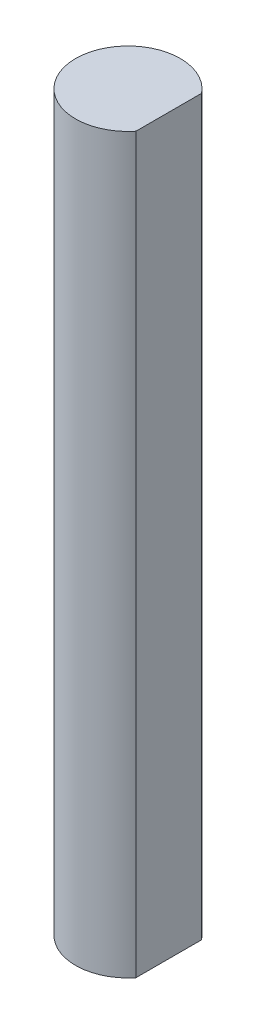
ISO-10303-21;
HEADER;
FILE_DESCRIPTION(('STEP AP214'),'2;1');
FILE_NAME('part.step','',(''),(''),'','','');
FILE_SCHEMA(('AUTOMOTIVE_DESIGN { 1 0 10303 214 1 1 1 1 }'));
ENDSEC;
DATA;
#1=APPLICATION_CONTEXT('core data for automotive mechanical design processes');
#2=APPLICATION_PROTOCOL_DEFINITION('international standard','automotive_design',2000,#1);
#3=PRODUCT_CONTEXT('',#1,'mechanical');
#4=PRODUCT('Part','Part','',(#3));
#5=PRODUCT_RELATED_PRODUCT_CATEGORY('part','',(#4));
#6=PRODUCT_DEFINITION_FORMATION('','',#4);
#7=PRODUCT_DEFINITION_CONTEXT('part definition',#1,'design');
#8=PRODUCT_DEFINITION('design','',#6,#7);
#9=PRODUCT_DEFINITION_SHAPE('','',#8);
#10=(LENGTH_UNIT() NAMED_UNIT(*) SI_UNIT(.MILLI.,.METRE.));
#11=(NAMED_UNIT(*) PLANE_ANGLE_UNIT() SI_UNIT($,.RADIAN.));
#12=(NAMED_UNIT(*) SI_UNIT($,.STERADIAN.) SOLID_ANGLE_UNIT());
#13=UNCERTAINTY_MEASURE_WITH_UNIT(LENGTH_MEASURE(1.E-05),#10,'distance_accuracy_value','');
#14=(GEOMETRIC_REPRESENTATION_CONTEXT(3) GLOBAL_UNCERTAINTY_ASSIGNED_CONTEXT((#13)) GLOBAL_UNIT_ASSIGNED_CONTEXT((#10,
#11,#12)) REPRESENTATION_CONTEXT('',''));
#15=CARTESIAN_POINT('',(0.,0.,0.));
#16=DIRECTION('',(0.,0.,1.));
#17=DIRECTION('',(1.,0.,0.));
#18=AXIS2_PLACEMENT_3D('',#15,#16,#17);
#19=CARTESIAN_POINT('',(0.,63.5,0.));
#20=DIRECTION('',(0.,-1.,0.));
#21=DIRECTION('',(0.,0.,-1.));
#22=AXIS2_PLACEMENT_3D('',#19,#20,#21);
#23=CYLINDRICAL_SURFACE('',#22,3.175);
#24=CARTESIAN_POINT('',(0.,44.45,0.));
#25=DIRECTION('',(0.,1.,0.));
#26=DIRECTION('',(0.,0.,1.));
#27=AXIS2_PLACEMENT_3D('',#24,#25,#26);
#28=CIRCLE('',#27,3.175);
#29=CARTESIAN_POINT('',(2.47212698024784,44.45,1.99228843130976));
#30=VERTEX_POINT('',#29);
#31=CARTESIAN_POINT('',(2.47212698024784,44.45,-1.99228843130976));
#32=VERTEX_POINT('',#31);
#33=EDGE_CURVE('E53',#30,#32,#28,.F.);
#34=ORIENTED_EDGE('',*,*,#33,.T.);
#35=DIRECTION('',(0.,-1.,0.));
#36=VECTOR('',#35,1.);
#37=CARTESIAN_POINT('',(2.47212698024784,63.5,-1.99228843130976));
#38=LINE('',#37,#36);
#39=CARTESIAN_POINT('',(2.47212698024784,0.,-1.99228843130976));
#40=VERTEX_POINT('',#39);
#41=EDGE_CURVE('E47',#32,#40,#38,.T.);
#42=ORIENTED_EDGE('',*,*,#41,.T.);
#43=CARTESIAN_POINT('',(0.,0.,0.));
#44=DIRECTION('',(0.,1.,0.));
#45=DIRECTION('',(0.,0.,1.));
#46=AXIS2_PLACEMENT_3D('',#43,#44,#45);
#47=CIRCLE('',#46,3.175);
#48=CARTESIAN_POINT('',(2.47212698024784,0.,1.99228843130976));
#49=VERTEX_POINT('',#48);
#50=EDGE_CURVE('E68',#40,#49,#47,.T.);
#51=ORIENTED_EDGE('',*,*,#50,.T.);
#52=DIRECTION('',(0.,-1.,0.));
#53=VECTOR('',#52,1.);
#54=CARTESIAN_POINT('',(2.47212698024784,63.5,1.99228843130976));
#55=LINE('',#54,#53);
#56=EDGE_CURVE('E12',#30,#49,#55,.T.);
#57=ORIENTED_EDGE('',*,*,#56,.F.);
#58=EDGE_LOOP('',(#34,#42,#51,#57));
#59=FACE_BOUND('',#58,.T.);
#60=ADVANCED_FACE('F40',(#59),#23,.T.);
#61=CARTESIAN_POINT('',(2.47212698024784,63.5,-1.99228843130976));
#62=DIRECTION('',(-1.,0.,0.));
#63=DIRECTION('',(0.,0.,1.));
#64=AXIS2_PLACEMENT_3D('',#61,#62,#63);
#65=PLANE('',#64);
#66=DIRECTION('',(0.,0.,1.));
#67=VECTOR('',#66,1.);
#68=CARTESIAN_POINT('',(2.47212698024784,44.45,1.99228843130976));
#69=LINE('',#68,#67);
#70=EDGE_CURVE('E64',#32,#30,#69,.T.);
#71=ORIENTED_EDGE('',*,*,#70,.T.);
#72=ORIENTED_EDGE('',*,*,#56,.T.);
#73=DIRECTION('',(0.,0.,-1.));
#74=VECTOR('',#73,1.);
#75=CARTESIAN_POINT('',(2.47212698024784,0.,-1.99228843130976));
#76=LINE('',#75,#74);
#77=EDGE_CURVE('E73',#49,#40,#76,.T.);
#78=ORIENTED_EDGE('',*,*,#77,.T.);
#79=ORIENTED_EDGE('',*,*,#41,.F.);
#80=EDGE_LOOP('',(#71,#72,#78,#79));
#81=FACE_BOUND('',#80,.T.);
#82=ADVANCED_FACE('F71',(#81),#65,.F.);
#83=CARTESIAN_POINT('',(0.,0.,0.));
#84=DIRECTION('',(0.,1.,0.));
#85=DIRECTION('',(0.,0.,1.));
#86=AXIS2_PLACEMENT_3D('',#83,#84,#85);
#87=PLANE('',#86);
#88=ORIENTED_EDGE('',*,*,#50,.F.);
#89=ORIENTED_EDGE('',*,*,#77,.F.);
#90=EDGE_LOOP('',(#88,#89));
#91=FACE_BOUND('',#90,.T.);
#92=ADVANCED_FACE('F78',(#91),#87,.F.);
#93=CARTESIAN_POINT('',(0.,44.45,0.));
#94=DIRECTION('',(0.,1.,0.));
#95=DIRECTION('',(0.,0.,1.));
#96=AXIS2_PLACEMENT_3D('',#93,#94,#95);
#97=PLANE('',#96);
#98=ORIENTED_EDGE('',*,*,#33,.F.);
#99=ORIENTED_EDGE('',*,*,#70,.F.);
#100=EDGE_LOOP('',(#98,#99));
#101=FACE_BOUND('',#100,.T.);
#102=ADVANCED_FACE('F65',(#101),#97,.T.);
#103=CLOSED_SHELL('',(#60,#82,#92,#102));
#104=MANIFOLD_SOLID_BREP('B2',#103);
#105=ADVANCED_BREP_SHAPE_REPRESENTATION('',(#18,#104),#14);
#106=SHAPE_DEFINITION_REPRESENTATION(#9,#105);
ENDSEC;
END-ISO-10303-21;
